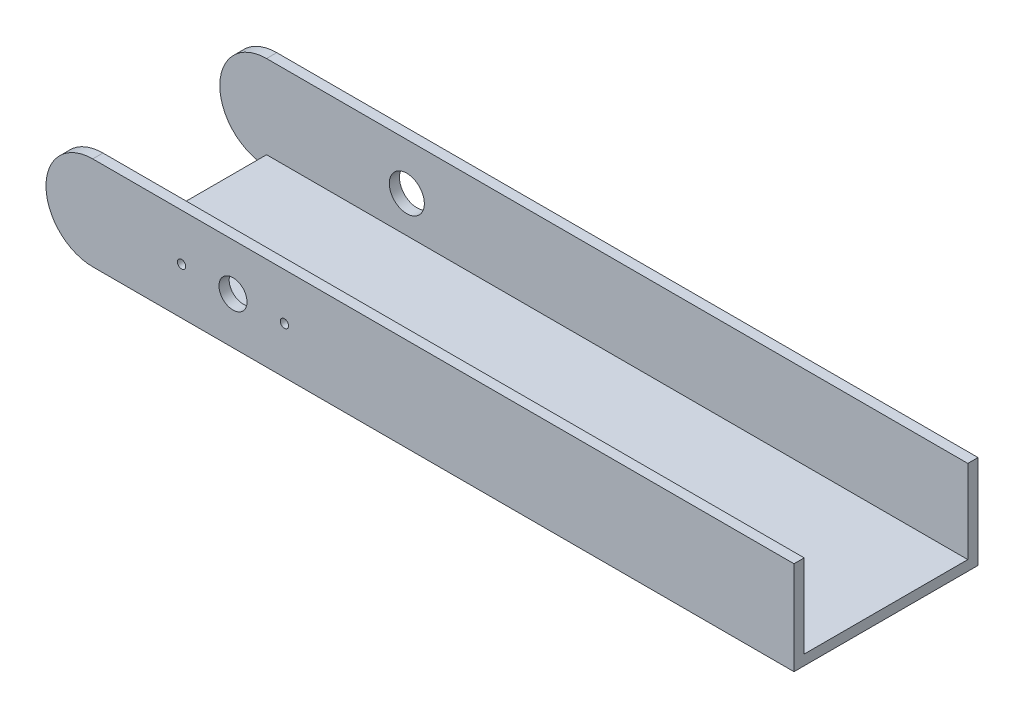
ISO-10303-21;
HEADER;
FILE_DESCRIPTION(('STEP AP214'),'2;1');
FILE_NAME('part.step','',(''),(''),'','','');
FILE_SCHEMA(('AUTOMOTIVE_DESIGN { 1 0 10303 214 1 1 1 1 }'));
ENDSEC;
DATA;
#1=APPLICATION_CONTEXT('core data for automotive mechanical design processes');
#2=APPLICATION_PROTOCOL_DEFINITION('international standard','automotive_design',2000,#1);
#3=PRODUCT_CONTEXT('',#1,'mechanical');
#4=PRODUCT('Part','Part','',(#3));
#5=PRODUCT_RELATED_PRODUCT_CATEGORY('part','',(#4));
#6=PRODUCT_DEFINITION_FORMATION('','',#4);
#7=PRODUCT_DEFINITION_CONTEXT('part definition',#1,'design');
#8=PRODUCT_DEFINITION('design','',#6,#7);
#9=PRODUCT_DEFINITION_SHAPE('','',#8);
#10=(LENGTH_UNIT() NAMED_UNIT(*) SI_UNIT(.MILLI.,.METRE.));
#11=(NAMED_UNIT(*) PLANE_ANGLE_UNIT() SI_UNIT($,.RADIAN.));
#12=(NAMED_UNIT(*) SI_UNIT($,.STERADIAN.) SOLID_ANGLE_UNIT());
#13=UNCERTAINTY_MEASURE_WITH_UNIT(LENGTH_MEASURE(1.E-05),#10,'distance_accuracy_value','');
#14=(GEOMETRIC_REPRESENTATION_CONTEXT(3) GLOBAL_UNCERTAINTY_ASSIGNED_CONTEXT((#13)) GLOBAL_UNIT_ASSIGNED_CONTEXT((#10,
#11,#12)) REPRESENTATION_CONTEXT('',''));
#15=CARTESIAN_POINT('',(0.,0.,0.));
#16=DIRECTION('',(0.,0.,1.));
#17=DIRECTION('',(1.,0.,0.));
#18=AXIS2_PLACEMENT_3D('',#15,#16,#17);
#19=CARTESIAN_POINT('',(-2.23406487753763E-06,12.7,2.7686));
#20=DIRECTION('',(0.,0.,-1.));
#21=DIRECTION('',(-1.,0.,0.));
#22=AXIS2_PLACEMENT_3D('',#19,#20,#21);
#23=CYLINDRICAL_SURFACE('',#22,12.7000000000002);
#24=CARTESIAN_POINT('',(-2.23406487753763E-06,12.7,0.));
#25=DIRECTION('',(0.,0.,1.));
#26=DIRECTION('',(1.,0.,0.));
#27=AXIS2_PLACEMENT_3D('',#24,#25,#26);
#28=CIRCLE('',#27,12.7000000000002);
#29=CARTESIAN_POINT('',(-4.46812975507527E-06,25.4,0.));
#30=VERTEX_POINT('',#29);
#31=CARTESIAN_POINT('',(0.,0.,0.));
#32=VERTEX_POINT('',#31);
#33=EDGE_CURVE('E199',#30,#32,#28,.T.);
#34=ORIENTED_EDGE('',*,*,#33,.T.);
#35=DIRECTION('',(0.,0.,-1.));
#36=VECTOR('',#35,1.);
#37=CARTESIAN_POINT('',(0.,0.,2.7686));
#38=LINE('',#37,#36);
#39=CARTESIAN_POINT('',(0.,0.,2.7686));
#40=VERTEX_POINT('',#39);
#41=EDGE_CURVE('E13',#40,#32,#38,.T.);
#42=ORIENTED_EDGE('',*,*,#41,.F.);
#43=CARTESIAN_POINT('',(-2.23406487753763E-06,12.7,2.7686));
#44=DIRECTION('',(0.,0.,1.));
#45=DIRECTION('',(1.,0.,0.));
#46=AXIS2_PLACEMENT_3D('',#43,#44,#45);
#47=CIRCLE('',#46,12.7000000000002);
#48=CARTESIAN_POINT('',(-4.46812975507527E-06,25.4,2.7686));
#49=VERTEX_POINT('',#48);
#50=EDGE_CURVE('E202',#49,#40,#47,.T.);
#51=ORIENTED_EDGE('',*,*,#50,.F.);
#52=DIRECTION('',(0.,0.,-1.));
#53=VECTOR('',#52,1.);
#54=CARTESIAN_POINT('',(-4.46812975507527E-06,25.4,2.7686));
#55=LINE('',#54,#53);
#56=EDGE_CURVE('E207',#49,#30,#55,.T.);
#57=ORIENTED_EDGE('',*,*,#56,.T.);
#58=EDGE_LOOP('',(#34,#42,#51,#57));
#59=FACE_BOUND('',#58,.T.);
#60=ADVANCED_FACE('F46',(#59),#23,.T.);
#61=CARTESIAN_POINT('',(0.,0.,2.7686));
#62=DIRECTION('',(0.,1.,0.));
#63=DIRECTION('',(0.,0.,1.));
#64=AXIS2_PLACEMENT_3D('',#61,#62,#63);
#65=PLANE('',#64);
#66=ORIENTED_EDGE('',*,*,#41,.T.);
#67=DIRECTION('',(0.,0.,1.));
#68=VECTOR('',#67,1.);
#69=CARTESIAN_POINT('',(-2.2340646832486E-06,0.,-44.45));
#70=LINE('',#69,#68);
#71=CARTESIAN_POINT('',(-2.2340646832486E-06,0.,-44.45));
#72=VERTEX_POINT('',#71);
#73=EDGE_CURVE('E181',#72,#32,#70,.T.);
#74=ORIENTED_EDGE('',*,*,#73,.F.);
#75=DIRECTION('',(0.,0.,1.));
#76=VECTOR('',#75,1.);
#77=CARTESIAN_POINT('',(0.,0.,-47.2186));
#78=LINE('',#77,#76);
#79=CARTESIAN_POINT('',(0.,0.,-47.2186));
#80=VERTEX_POINT('',#79);
#81=EDGE_CURVE('E143',#80,#72,#78,.T.);
#82=ORIENTED_EDGE('',*,*,#81,.F.);
#83=DIRECTION('',(-1.,0.,0.));
#84=VECTOR('',#83,1.);
#85=CARTESIAN_POINT('',(190.499997765935,0.,-47.2186));
#86=LINE('',#85,#84);
#87=CARTESIAN_POINT('',(190.499997765935,0.,-47.2186));
#88=VERTEX_POINT('',#87);
#89=EDGE_CURVE('E133',#88,#80,#86,.T.);
#90=ORIENTED_EDGE('',*,*,#89,.F.);
#91=DIRECTION('',(0.,0.,-1.));
#92=VECTOR('',#91,1.);
#93=CARTESIAN_POINT('',(190.499997765935,0.,2.7686));
#94=LINE('',#93,#92);
#95=CARTESIAN_POINT('',(190.499997765935,0.,2.7686));
#96=VERTEX_POINT('',#95);
#97=EDGE_CURVE('E54',#96,#88,#94,.T.);
#98=ORIENTED_EDGE('',*,*,#97,.F.);
#99=DIRECTION('',(1.,0.,0.));
#100=VECTOR('',#99,1.);
#101=CARTESIAN_POINT('',(0.,0.,2.7686));
#102=LINE('',#101,#100);
#103=EDGE_CURVE('E90',#40,#96,#102,.T.);
#104=ORIENTED_EDGE('',*,*,#103,.F.);
#105=EDGE_LOOP('',(#66,#74,#82,#90,#98,#104));
#106=FACE_BOUND('',#105,.T.);
#107=ADVANCED_FACE('F140',(#106),#65,.F.);
#108=CARTESIAN_POINT('',(190.499997765935,0.,2.7686));
#109=DIRECTION('',(-1.,0.,0.));
#110=DIRECTION('',(0.,0.,1.));
#111=AXIS2_PLACEMENT_3D('',#108,#109,#110);
#112=PLANE('',#111);
#113=ORIENTED_EDGE('',*,*,#97,.T.);
#114=DIRECTION('',(0.,-1.,0.));
#115=VECTOR('',#114,1.);
#116=CARTESIAN_POINT('',(190.499997765935,12.7,-47.2186));
#117=LINE('',#116,#115);
#118=CARTESIAN_POINT('',(190.499997765935,25.4,-47.2186));
#119=VERTEX_POINT('',#118);
#120=EDGE_CURVE('E127',#119,#88,#117,.T.);
#121=ORIENTED_EDGE('',*,*,#120,.F.);
#122=DIRECTION('',(0.,0.,1.));
#123=VECTOR('',#122,1.);
#124=CARTESIAN_POINT('',(190.499997765935,25.4,-47.2186));
#125=LINE('',#124,#123);
#126=CARTESIAN_POINT('',(190.499997765935,25.4,-44.45));
#127=VERTEX_POINT('',#126);
#128=EDGE_CURVE('E151',#119,#127,#125,.T.);
#129=ORIENTED_EDGE('',*,*,#128,.T.);
#130=DIRECTION('',(0.,-1.,0.));
#131=VECTOR('',#130,1.);
#132=CARTESIAN_POINT('',(190.499997765935,12.7,-44.45));
#133=LINE('',#132,#131);
#134=CARTESIAN_POINT('',(190.499997765935,2.7686,-44.45));
#135=VERTEX_POINT('',#134);
#136=EDGE_CURVE('E152',#127,#135,#133,.T.);
#137=ORIENTED_EDGE('',*,*,#136,.T.);
#138=DIRECTION('',(0.,0.,1.));
#139=VECTOR('',#138,1.);
#140=CARTESIAN_POINT('',(190.499997765935,2.7686,-44.45));
#141=LINE('',#140,#139);
#142=CARTESIAN_POINT('',(190.499997765935,2.7686,0.));
#143=VERTEX_POINT('',#142);
#144=EDGE_CURVE('E178',#135,#143,#141,.T.);
#145=ORIENTED_EDGE('',*,*,#144,.T.);
#146=DIRECTION('',(0.,1.,0.));
#147=VECTOR('',#146,1.);
#148=CARTESIAN_POINT('',(190.499997765935,0.,0.));
#149=LINE('',#148,#147);
#150=CARTESIAN_POINT('',(190.499997765935,25.4,0.));
#151=VERTEX_POINT('',#150);
#152=EDGE_CURVE('E77',#143,#151,#149,.T.);
#153=ORIENTED_EDGE('',*,*,#152,.T.);
#154=DIRECTION('',(0.,0.,-1.));
#155=VECTOR('',#154,1.);
#156=CARTESIAN_POINT('',(190.499997765935,25.4,2.7686));
#157=LINE('',#156,#155);
#158=CARTESIAN_POINT('',(190.499997765935,25.4,2.7686));
#159=VERTEX_POINT('',#158);
#160=EDGE_CURVE('E130',#159,#151,#157,.T.);
#161=ORIENTED_EDGE('',*,*,#160,.F.);
#162=DIRECTION('',(0.,1.,0.));
#163=VECTOR('',#162,1.);
#164=CARTESIAN_POINT('',(190.499997765935,0.,2.7686));
#165=LINE('',#164,#163);
#166=EDGE_CURVE('E128',#96,#159,#165,.T.);
#167=ORIENTED_EDGE('',*,*,#166,.F.);
#168=EDGE_LOOP('',(#113,#121,#129,#137,#145,#153,#161,#167));
#169=FACE_BOUND('',#168,.T.);
#170=ADVANCED_FACE('F125',(#169),#112,.F.);
#171=CARTESIAN_POINT('',(-4.46812975507527E-06,25.4,2.7686));
#172=DIRECTION('',(0.,-1.,0.));
#173=DIRECTION('',(0.,0.,-1.));
#174=AXIS2_PLACEMENT_3D('',#171,#172,#173);
#175=PLANE('',#174);
#176=DIRECTION('',(-1.,0.,0.));
#177=VECTOR('',#176,1.);
#178=CARTESIAN_POINT('',(-4.46812975507527E-06,25.4,0.));
#179=LINE('',#178,#177);
#180=EDGE_CURVE('E83',#151,#30,#179,.T.);
#181=ORIENTED_EDGE('',*,*,#180,.T.);
#182=ORIENTED_EDGE('',*,*,#56,.F.);
#183=DIRECTION('',(-1.,0.,0.));
#184=VECTOR('',#183,1.);
#185=CARTESIAN_POINT('',(-4.46812975507527E-06,25.4,2.7686));
#186=LINE('',#185,#184);
#187=EDGE_CURVE('E62',#159,#49,#186,.T.);
#188=ORIENTED_EDGE('',*,*,#187,.F.);
#189=ORIENTED_EDGE('',*,*,#160,.T.);
#190=EDGE_LOOP('',(#181,#182,#188,#189));
#191=FACE_BOUND('',#190,.T.);
#192=ADVANCED_FACE('F213',(#191),#175,.F.);
#193=CARTESIAN_POINT('',(-2.23406487753763E-06,12.7,2.7686));
#194=DIRECTION('',(0.,0.,1.));
#195=DIRECTION('',(1.,0.,0.));
#196=AXIS2_PLACEMENT_3D('',#193,#194,#195);
#197=PLANE('',#196);
#198=CARTESIAN_POINT('',(24.1299977659349,12.7,2.7686));
#199=DIRECTION('',(0.,0.,1.));
#200=DIRECTION('',(1.,0.,0.));
#201=AXIS2_PLACEMENT_3D('',#198,#199,#200);
#202=CIRCLE('',#201,1.1303);
#203=CARTESIAN_POINT('',(25.2602977659349,12.7,2.7686));
#204=VERTEX_POINT('',#203);
#205=EDGE_CURVE('E180',#204,#204,#202,.T.);
#206=ORIENTED_EDGE('',*,*,#205,.F.);
#207=EDGE_LOOP('',(#206));
#208=FACE_BOUND('',#207,.T.);
#209=CARTESIAN_POINT('',(52.0699977659349,12.7,2.7686));
#210=DIRECTION('',(0.,0.,1.));
#211=DIRECTION('',(1.,0.,0.));
#212=AXIS2_PLACEMENT_3D('',#209,#210,#211);
#213=CIRCLE('',#212,1.1303);
#214=CARTESIAN_POINT('',(53.2002977659349,12.7,2.7686));
#215=VERTEX_POINT('',#214);
#216=EDGE_CURVE('E188',#215,#215,#213,.T.);
#217=ORIENTED_EDGE('',*,*,#216,.F.);
#218=EDGE_LOOP('',(#217));
#219=FACE_BOUND('',#218,.T.);
#220=CARTESIAN_POINT('',(38.0999977659349,12.7,2.7686));
#221=DIRECTION('',(0.,0.,1.));
#222=DIRECTION('',(1.,0.,0.));
#223=AXIS2_PLACEMENT_3D('',#220,#221,#222);
#224=CIRCLE('',#223,3.81);
#225=CARTESIAN_POINT('',(41.9099977659349,12.7,2.7686));
#226=VERTEX_POINT('',#225);
#227=EDGE_CURVE('E187',#226,#226,#224,.T.);
#228=ORIENTED_EDGE('',*,*,#227,.F.);
#229=EDGE_LOOP('',(#228));
#230=FACE_BOUND('',#229,.T.);
#231=ORIENTED_EDGE('',*,*,#50,.T.);
#232=ORIENTED_EDGE('',*,*,#103,.T.);
#233=ORIENTED_EDGE('',*,*,#166,.T.);
#234=ORIENTED_EDGE('',*,*,#187,.T.);
#235=EDGE_LOOP('',(#231,#232,#233,#234));
#236=FACE_BOUND('',#235,.T.);
#237=ADVANCED_FACE('F221',(#208,#219,#230,#236),#197,.T.);
#238=CARTESIAN_POINT('',(-2.23406487753763E-06,12.7,0.));
#239=DIRECTION('',(0.,0.,1.));
#240=DIRECTION('',(1.,0.,0.));
#241=AXIS2_PLACEMENT_3D('',#238,#239,#240);
#242=PLANE('',#241);
#243=CARTESIAN_POINT('',(24.1299977659349,12.7,0.));
#244=DIRECTION('',(0.,0.,1.));
#245=DIRECTION('',(1.,0.,0.));
#246=AXIS2_PLACEMENT_3D('',#243,#244,#245);
#247=CIRCLE('',#246,1.1303);
#248=CARTESIAN_POINT('',(25.2602977659349,12.7,0.));
#249=VERTEX_POINT('',#248);
#250=EDGE_CURVE('E191',#249,#249,#247,.T.);
#251=ORIENTED_EDGE('',*,*,#250,.T.);
#252=EDGE_LOOP('',(#251));
#253=FACE_BOUND('',#252,.T.);
#254=CARTESIAN_POINT('',(52.0699977659349,12.7,0.));
#255=DIRECTION('',(0.,0.,1.));
#256=DIRECTION('',(1.,0.,0.));
#257=AXIS2_PLACEMENT_3D('',#254,#255,#256);
#258=CIRCLE('',#257,1.1303);
#259=CARTESIAN_POINT('',(53.2002977659349,12.7,0.));
#260=VERTEX_POINT('',#259);
#261=EDGE_CURVE('E184',#260,#260,#258,.T.);
#262=ORIENTED_EDGE('',*,*,#261,.T.);
#263=EDGE_LOOP('',(#262));
#264=FACE_BOUND('',#263,.T.);
#265=CARTESIAN_POINT('',(38.0999977659349,12.7,0.));
#266=DIRECTION('',(0.,0.,1.));
#267=DIRECTION('',(1.,0.,0.));
#268=AXIS2_PLACEMENT_3D('',#265,#266,#267);
#269=CIRCLE('',#268,3.81);
#270=CARTESIAN_POINT('',(41.9099977659349,12.7,0.));
#271=VERTEX_POINT('',#270);
#272=EDGE_CURVE('E196',#271,#271,#269,.T.);
#273=ORIENTED_EDGE('',*,*,#272,.T.);
#274=EDGE_LOOP('',(#273));
#275=FACE_BOUND('',#274,.T.);
#276=ORIENTED_EDGE('',*,*,#152,.F.);
#277=DIRECTION('',(-1.,0.,0.));
#278=VECTOR('',#277,1.);
#279=CARTESIAN_POINT('',(-2.23406487753763E-06,2.7686,0.));
#280=LINE('',#279,#278);
#281=CARTESIAN_POINT('',(-2.2340646832486E-06,2.7686,0.));
#282=VERTEX_POINT('',#281);
#283=EDGE_CURVE('E165',#143,#282,#280,.T.);
#284=ORIENTED_EDGE('',*,*,#283,.T.);
#285=DIRECTION('',(0.,-1.,0.));
#286=VECTOR('',#285,1.);
#287=CARTESIAN_POINT('',(-2.2340646832486E-06,12.7,0.));
#288=LINE('',#287,#286);
#289=EDGE_CURVE('E170',#282,#32,#288,.T.);
#290=ORIENTED_EDGE('',*,*,#289,.T.);
#291=ORIENTED_EDGE('',*,*,#33,.F.);
#292=ORIENTED_EDGE('',*,*,#180,.F.);
#293=EDGE_LOOP('',(#276,#284,#290,#291,#292));
#294=FACE_BOUND('',#293,.T.);
#295=ADVANCED_FACE('F216',(#253,#264,#275,#294),#242,.F.);
#296=CARTESIAN_POINT('',(38.0999977659349,12.7,0.));
#297=DIRECTION('',(0.,0.,1.));
#298=DIRECTION('',(1.,0.,0.));
#299=AXIS2_PLACEMENT_3D('',#296,#297,#298);
#300=CYLINDRICAL_SURFACE('',#299,3.81);
#301=ORIENTED_EDGE('',*,*,#272,.F.);
#302=EDGE_LOOP('',(#301));
#303=FACE_BOUND('',#302,.T.);
#304=ORIENTED_EDGE('',*,*,#227,.T.);
#305=EDGE_LOOP('',(#304));
#306=FACE_BOUND('',#305,.T.);
#307=ADVANCED_FACE('F229',(#303,#306),#300,.F.);
#308=CARTESIAN_POINT('',(52.0699977659349,12.7,0.));
#309=DIRECTION('',(0.,0.,1.));
#310=DIRECTION('',(1.,0.,0.));
#311=AXIS2_PLACEMENT_3D('',#308,#309,#310);
#312=CYLINDRICAL_SURFACE('',#311,1.1303);
#313=ORIENTED_EDGE('',*,*,#261,.F.);
#314=EDGE_LOOP('',(#313));
#315=FACE_BOUND('',#314,.T.);
#316=ORIENTED_EDGE('',*,*,#216,.T.);
#317=EDGE_LOOP('',(#316));
#318=FACE_BOUND('',#317,.T.);
#319=ADVANCED_FACE('F270',(#315,#318),#312,.F.);
#320=CARTESIAN_POINT('',(24.1299977659349,12.7,0.));
#321=DIRECTION('',(0.,0.,1.));
#322=DIRECTION('',(1.,0.,0.));
#323=AXIS2_PLACEMENT_3D('',#320,#321,#322);
#324=CYLINDRICAL_SURFACE('',#323,1.1303);
#325=ORIENTED_EDGE('',*,*,#250,.F.);
#326=EDGE_LOOP('',(#325));
#327=FACE_BOUND('',#326,.T.);
#328=ORIENTED_EDGE('',*,*,#205,.T.);
#329=EDGE_LOOP('',(#328));
#330=FACE_BOUND('',#329,.T.);
#331=ADVANCED_FACE('F277',(#327,#330),#324,.F.);
#332=CARTESIAN_POINT('',(-2.23406487753763E-06,2.7686,-44.45));
#333=DIRECTION('',(0.,1.,0.));
#334=DIRECTION('',(0.,0.,1.));
#335=AXIS2_PLACEMENT_3D('',#332,#333,#334);
#336=PLANE('',#335);
#337=ORIENTED_EDGE('',*,*,#283,.F.);
#338=ORIENTED_EDGE('',*,*,#144,.F.);
#339=DIRECTION('',(-1.,0.,0.));
#340=VECTOR('',#339,1.);
#341=CARTESIAN_POINT('',(-2.23406487753763E-06,2.7686,-44.45));
#342=LINE('',#341,#340);
#343=CARTESIAN_POINT('',(-2.2340646832486E-06,2.7686,-44.45));
#344=VERTEX_POINT('',#343);
#345=EDGE_CURVE('E166',#135,#344,#342,.T.);
#346=ORIENTED_EDGE('',*,*,#345,.T.);
#347=DIRECTION('',(0.,0.,1.));
#348=VECTOR('',#347,1.);
#349=CARTESIAN_POINT('',(-2.2340646832486E-06,2.7686,-44.45));
#350=LINE('',#349,#348);
#351=EDGE_CURVE('E173',#344,#282,#350,.T.);
#352=ORIENTED_EDGE('',*,*,#351,.T.);
#353=EDGE_LOOP('',(#337,#338,#346,#352));
#354=FACE_BOUND('',#353,.T.);
#355=ADVANCED_FACE('F285',(#354),#336,.T.);
#356=CARTESIAN_POINT('',(-2.2340646832486E-06,12.7,-44.45));
#357=DIRECTION('',(-1.,0.,0.));
#358=DIRECTION('',(0.,0.,1.));
#359=AXIS2_PLACEMENT_3D('',#356,#357,#358);
#360=PLANE('',#359);
#361=ORIENTED_EDGE('',*,*,#289,.F.);
#362=ORIENTED_EDGE('',*,*,#351,.F.);
#363=DIRECTION('',(0.,-1.,0.));
#364=VECTOR('',#363,1.);
#365=CARTESIAN_POINT('',(-2.2340646832486E-06,12.7,-44.45));
#366=LINE('',#365,#364);
#367=EDGE_CURVE('E169',#344,#72,#366,.T.);
#368=ORIENTED_EDGE('',*,*,#367,.T.);
#369=ORIENTED_EDGE('',*,*,#73,.T.);
#370=EDGE_LOOP('',(#361,#362,#368,#369));
#371=FACE_BOUND('',#370,.T.);
#372=ADVANCED_FACE('F304',(#371),#360,.T.);
#373=CARTESIAN_POINT('',(-2.23406487753763E-06,12.7,-44.45));
#374=DIRECTION('',(0.,0.,1.));
#375=DIRECTION('',(1.,0.,0.));
#376=AXIS2_PLACEMENT_3D('',#373,#374,#375);
#377=PLANE('',#376);
#378=CARTESIAN_POINT('',(38.0999977659349,12.7,-44.45));
#379=DIRECTION('',(0.,0.,1.));
#380=DIRECTION('',(1.,0.,0.));
#381=AXIS2_PLACEMENT_3D('',#378,#379,#380);
#382=CIRCLE('',#381,4.7625);
#383=CARTESIAN_POINT('',(42.8624977659349,12.7,-44.45));
#384=VERTEX_POINT('',#383);
#385=EDGE_CURVE('E156',#384,#384,#382,.T.);
#386=ORIENTED_EDGE('',*,*,#385,.F.);
#387=EDGE_LOOP('',(#386));
#388=FACE_BOUND('',#387,.T.);
#389=ORIENTED_EDGE('',*,*,#345,.F.);
#390=ORIENTED_EDGE('',*,*,#136,.F.);
#391=DIRECTION('',(1.,0.,0.));
#392=VECTOR('',#391,1.);
#393=CARTESIAN_POINT('',(-4.46812975507527E-06,25.4,-44.45));
#394=LINE('',#393,#392);
#395=CARTESIAN_POINT('',(-4.46812975507527E-06,25.4,-44.45));
#396=VERTEX_POINT('',#395);
#397=EDGE_CURVE('E138',#396,#127,#394,.T.);
#398=ORIENTED_EDGE('',*,*,#397,.F.);
#399=CARTESIAN_POINT('',(-2.23406487753763E-06,12.7,-44.45));
#400=DIRECTION('',(0.,0.,-1.));
#401=DIRECTION('',(1.,0.,0.));
#402=AXIS2_PLACEMENT_3D('',#399,#400,#401);
#403=CIRCLE('',#402,12.7000000000002);
#404=EDGE_CURVE('E155',#72,#396,#403,.T.);
#405=ORIENTED_EDGE('',*,*,#404,.F.);
#406=ORIENTED_EDGE('',*,*,#367,.F.);
#407=EDGE_LOOP('',(#389,#390,#398,#405,#406));
#408=FACE_BOUND('',#407,.T.);
#409=ADVANCED_FACE('F311',(#388,#408),#377,.T.);
#410=CARTESIAN_POINT('',(-2.23406487753763E-06,12.7,-47.2186));
#411=DIRECTION('',(0.,0.,1.));
#412=DIRECTION('',(1.,0.,0.));
#413=AXIS2_PLACEMENT_3D('',#410,#411,#412);
#414=CYLINDRICAL_SURFACE('',#413,12.7000000000002);
#415=ORIENTED_EDGE('',*,*,#404,.T.);
#416=DIRECTION('',(0.,0.,1.));
#417=VECTOR('',#416,1.);
#418=CARTESIAN_POINT('',(-4.46812975507527E-06,25.4,-47.2186));
#419=LINE('',#418,#417);
#420=CARTESIAN_POINT('',(-4.46812975507527E-06,25.4,-47.2186));
#421=VERTEX_POINT('',#420);
#422=EDGE_CURVE('E161',#421,#396,#419,.T.);
#423=ORIENTED_EDGE('',*,*,#422,.F.);
#424=CARTESIAN_POINT('',(-2.23406487753763E-06,12.7,-47.2186));
#425=DIRECTION('',(0.,0.,-1.));
#426=DIRECTION('',(1.,0.,0.));
#427=AXIS2_PLACEMENT_3D('',#424,#425,#426);
#428=CIRCLE('',#427,12.7000000000002);
#429=EDGE_CURVE('E145',#80,#421,#428,.T.);
#430=ORIENTED_EDGE('',*,*,#429,.F.);
#431=ORIENTED_EDGE('',*,*,#81,.T.);
#432=EDGE_LOOP('',(#415,#423,#430,#431));
#433=FACE_BOUND('',#432,.T.);
#434=ADVANCED_FACE('F318',(#433),#414,.T.);
#435=CARTESIAN_POINT('',(-4.46812975507527E-06,25.4,-47.2186));
#436=DIRECTION('',(0.,-1.,0.));
#437=DIRECTION('',(0.,0.,-1.));
#438=AXIS2_PLACEMENT_3D('',#435,#436,#437);
#439=PLANE('',#438);
#440=ORIENTED_EDGE('',*,*,#397,.T.);
#441=ORIENTED_EDGE('',*,*,#128,.F.);
#442=DIRECTION('',(1.,0.,0.));
#443=VECTOR('',#442,1.);
#444=CARTESIAN_POINT('',(-4.46812975507527E-06,25.4,-47.2186));
#445=LINE('',#444,#443);
#446=EDGE_CURVE('E136',#421,#119,#445,.T.);
#447=ORIENTED_EDGE('',*,*,#446,.F.);
#448=ORIENTED_EDGE('',*,*,#422,.T.);
#449=EDGE_LOOP('',(#440,#441,#447,#448));
#450=FACE_BOUND('',#449,.T.);
#451=ADVANCED_FACE('F326',(#450),#439,.F.);
#452=CARTESIAN_POINT('',(-2.23406487753763E-06,12.7,-47.2186));
#453=DIRECTION('',(0.,0.,1.));
#454=DIRECTION('',(1.,0.,0.));
#455=AXIS2_PLACEMENT_3D('',#452,#453,#454);
#456=PLANE('',#455);
#457=CARTESIAN_POINT('',(38.0999977659349,12.7,-47.2186));
#458=DIRECTION('',(0.,0.,1.));
#459=DIRECTION('',(1.,0.,0.));
#460=AXIS2_PLACEMENT_3D('',#457,#458,#459);
#461=CIRCLE('',#460,4.7625);
#462=CARTESIAN_POINT('',(42.8624977659349,12.7,-47.2186));
#463=VERTEX_POINT('',#462);
#464=EDGE_CURVE('E355',#463,#463,#461,.T.);
#465=ORIENTED_EDGE('',*,*,#464,.T.);
#466=EDGE_LOOP('',(#465));
#467=FACE_BOUND('',#466,.T.);
#468=ORIENTED_EDGE('',*,*,#120,.T.);
#469=ORIENTED_EDGE('',*,*,#89,.T.);
#470=ORIENTED_EDGE('',*,*,#429,.T.);
#471=ORIENTED_EDGE('',*,*,#446,.T.);
#472=EDGE_LOOP('',(#468,#469,#470,#471));
#473=FACE_BOUND('',#472,.T.);
#474=ADVANCED_FACE('F132',(#467,#473),#456,.F.);
#475=CARTESIAN_POINT('',(38.0999977659349,12.7,-30.9796158183963));
#476=DIRECTION('',(0.,0.,-1.));
#477=DIRECTION('',(-1.,0.,0.));
#478=AXIS2_PLACEMENT_3D('',#475,#476,#477);
#479=CYLINDRICAL_SURFACE('',#478,4.7625);
#480=ORIENTED_EDGE('',*,*,#464,.F.);
#481=EDGE_LOOP('',(#480));
#482=FACE_BOUND('',#481,.T.);
#483=ORIENTED_EDGE('',*,*,#385,.T.);
#484=EDGE_LOOP('',(#483));
#485=FACE_BOUND('',#484,.T.);
#486=ADVANCED_FACE('F341',(#482,#485),#479,.F.);
#487=CLOSED_SHELL('',(#60,#107,#170,#192,#237,#295,#307,#319,#331,#355,#372,#409,#434,#451,#474,#486));
#488=MANIFOLD_SOLID_BREP('B2',#487);
#489=ADVANCED_BREP_SHAPE_REPRESENTATION('',(#18,#488),#14);
#490=SHAPE_DEFINITION_REPRESENTATION(#9,#489);
ENDSEC;
END-ISO-10303-21;
